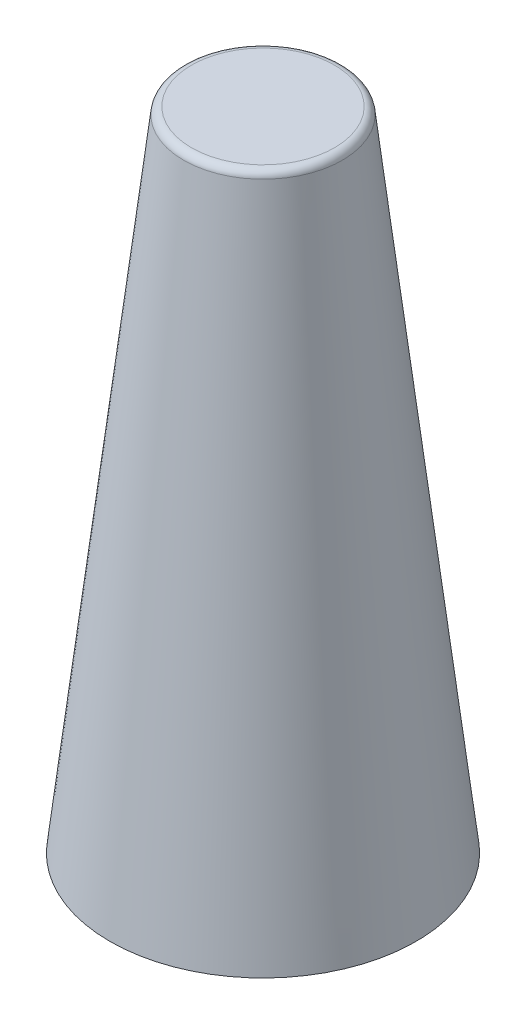
ISO-10303-21;
HEADER;
FILE_DESCRIPTION(('STEP AP214'),'2;1');
FILE_NAME('part.step','',(''),(''),'','','');
FILE_SCHEMA(('AUTOMOTIVE_DESIGN { 1 0 10303 214 1 1 1 1 }'));
ENDSEC;
DATA;
#1=APPLICATION_CONTEXT('core data for automotive mechanical design processes');
#2=APPLICATION_PROTOCOL_DEFINITION('international standard','automotive_design',2000,#1);
#3=PRODUCT_CONTEXT('',#1,'mechanical');
#4=PRODUCT('Part','Part','',(#3));
#5=PRODUCT_RELATED_PRODUCT_CATEGORY('part','',(#4));
#6=PRODUCT_DEFINITION_FORMATION('','',#4);
#7=PRODUCT_DEFINITION_CONTEXT('part definition',#1,'design');
#8=PRODUCT_DEFINITION('design','',#6,#7);
#9=PRODUCT_DEFINITION_SHAPE('','',#8);
#10=(LENGTH_UNIT() NAMED_UNIT(*) SI_UNIT(.MILLI.,.METRE.));
#11=(NAMED_UNIT(*) PLANE_ANGLE_UNIT() SI_UNIT($,.RADIAN.));
#12=(NAMED_UNIT(*) SI_UNIT($,.STERADIAN.) SOLID_ANGLE_UNIT());
#13=UNCERTAINTY_MEASURE_WITH_UNIT(LENGTH_MEASURE(1.E-05),#10,'distance_accuracy_value','');
#14=(GEOMETRIC_REPRESENTATION_CONTEXT(3) GLOBAL_UNCERTAINTY_ASSIGNED_CONTEXT((#13)) GLOBAL_UNIT_ASSIGNED_CONTEXT((#10,
#11,#12)) REPRESENTATION_CONTEXT('',''));
#15=CARTESIAN_POINT('',(0.,0.,0.));
#16=DIRECTION('',(0.,0.,1.));
#17=DIRECTION('',(1.,0.,0.));
#18=AXIS2_PLACEMENT_3D('',#15,#16,#17);
#19=CARTESIAN_POINT('',(0.,416.66959798995,0.));
#20=DIRECTION('',(0.,1.,0.));
#21=DIRECTION('',(0.,0.,1.));
#22=AXIS2_PLACEMENT_3D('',#19,#20,#21);
#23=PLANE('',#22);
#24=CARTESIAN_POINT('',(0.,416.66959798995,0.));
#25=DIRECTION('',(0.,1.,0.));
#26=DIRECTION('',(0.,0.,1.));
#27=AXIS2_PLACEMENT_3D('',#24,#25,#26);
#28=CIRCLE('',#27,91.0879119640147);
#29=CARTESIAN_POINT('',(0.,416.66959798995,91.0879119640147));
#30=VERTEX_POINT('',#29);
#31=EDGE_CURVE('E53',#30,#30,#28,.T.);
#32=ORIENTED_EDGE('',*,*,#31,.T.);
#33=EDGE_LOOP('',(#32));
#34=FACE_BOUND('',#33,.T.);
#35=ADVANCED_FACE('F44',(#34),#23,.T.);
#36=CARTESIAN_POINT('',(0.,416.66959798995,0.));
#37=DIRECTION('',(0.,-1.,0.));
#38=DIRECTION('',(0.,0.,-1.));
#39=AXIS2_PLACEMENT_3D('',#36,#37,#38);
#40=CONICAL_SURFACE('',#39,100.,0.114922724496329);
#41=CARTESIAN_POINT('',(0.,407.816297219638,0.));
#42=DIRECTION('',(0.,1.,0.));
#43=DIRECTION('',(0.,0.,1.));
#44=AXIS2_PLACEMENT_3D('',#41,#42,#43);
#45=CIRCLE('',#44,101.021948448578);
#46=CARTESIAN_POINT('',(0.,407.816297219638,101.021948448578));
#47=VERTEX_POINT('',#46);
#48=EDGE_CURVE('E10',#47,#47,#45,.F.);
#49=ORIENTED_EDGE('',*,*,#48,.T.);
#50=EDGE_LOOP('',(#49));
#51=FACE_BOUND('',#50,.T.);
#52=CARTESIAN_POINT('',(0.,-406.33040201005,0.));
#53=DIRECTION('',(0.,1.,0.));
#54=DIRECTION('',(0.,0.,1.));
#55=AXIS2_PLACEMENT_3D('',#52,#53,#54);
#56=CIRCLE('',#55,195.);
#57=CARTESIAN_POINT('',(0.,-406.33040201005,195.));
#58=VERTEX_POINT('',#57);
#59=EDGE_CURVE('E58',#58,#58,#56,.T.);
#60=ORIENTED_EDGE('',*,*,#59,.T.);
#61=EDGE_LOOP('',(#60));
#62=FACE_BOUND('',#61,.T.);
#63=ADVANCED_FACE('F96',(#51,#62),#40,.T.);
#64=CARTESIAN_POINT('',(0.,-406.33040201005,0.));
#65=DIRECTION('',(0.,1.,0.));
#66=DIRECTION('',(0.,0.,1.));
#67=AXIS2_PLACEMENT_3D('',#64,#65,#66);
#68=PLANE('',#67);
#69=ORIENTED_EDGE('',*,*,#59,.F.);
#70=EDGE_LOOP('',(#69));
#71=FACE_BOUND('',#70,.T.);
#72=ADVANCED_FACE('F94',(#71),#68,.F.);
#73=CARTESIAN_POINT('',(0.,406.66959798995,0.));
#74=DIRECTION('',(0.,1.,0.));
#75=DIRECTION('',(0.,0.,1.));
#76=AXIS2_PLACEMENT_3D('',#73,#74,#75);
#77=TOROIDAL_SURFACE('',#76,91.0879119640147,10.);
#78=ORIENTED_EDGE('',*,*,#48,.F.);
#79=EDGE_LOOP('',(#78));
#80=FACE_BOUND('',#79,.T.);
#81=ORIENTED_EDGE('',*,*,#31,.F.);
#82=EDGE_LOOP('',(#81));
#83=FACE_BOUND('',#82,.T.);
#84=ADVANCED_FACE('F46',(#80,#83),#77,.T.);
#85=CLOSED_SHELL('',(#35,#63,#72,#84));
#86=CARTESIAN_POINT('',(1.16521726812718E-13,-396.33040201005,0.));
#87=DIRECTION('',(0.,1.,0.));
#88=DIRECTION('',(0.,0.,1.));
#89=AXIS2_PLACEMENT_3D('',#86,#87,#88);
#90=PLANE('',#89);
#91=CARTESIAN_POINT('',(0.,-396.33040201005,0.));
#92=DIRECTION('',(0.,1.,0.));
#93=DIRECTION('',(0.,0.,1.));
#94=AXIS2_PLACEMENT_3D('',#91,#92,#93);
#95=CIRCLE('',#94,188.812485751145);
#96=CARTESIAN_POINT('',(0.,-396.33040201005,188.812485751145));
#97=VERTEX_POINT('',#96);
#98=EDGE_CURVE('E63',#97,#97,#95,.T.);
#99=ORIENTED_EDGE('',*,*,#98,.T.);
#100=EDGE_LOOP('',(#99));
#101=FACE_BOUND('',#100,.T.);
#102=ADVANCED_FACE('F84',(#101),#90,.T.);
#103=CARTESIAN_POINT('',(0.,406.66959798995,0.));
#104=DIRECTION('',(0.,-1.,0.));
#105=DIRECTION('',(0.,0.,-1.));
#106=AXIS2_PLACEMENT_3D('',#103,#104,#105);
#107=CONICAL_SURFACE('',#106,96.1211127256283,0.114922724496329);
#108=ORIENTED_EDGE('',*,*,#98,.F.);
#109=EDGE_LOOP('',(#108));
#110=FACE_BOUND('',#109,.T.);
#111=CARTESIAN_POINT('',(0.,406.66959798995,0.));
#112=DIRECTION('',(0.,1.,0.));
#113=DIRECTION('',(0.,0.,1.));
#114=AXIS2_PLACEMENT_3D('',#111,#112,#113);
#115=CIRCLE('',#114,96.1211127256283);
#116=CARTESIAN_POINT('',(0.,406.66959798995,96.1211127256283));
#117=VERTEX_POINT('',#116);
#118=EDGE_CURVE('E69',#117,#117,#115,.T.);
#119=ORIENTED_EDGE('',*,*,#118,.T.);
#120=EDGE_LOOP('',(#119));
#121=FACE_BOUND('',#120,.T.);
#122=ADVANCED_FACE('F74',(#110,#121),#107,.F.);
#123=CARTESIAN_POINT('',(0.,406.66959798995,0.));
#124=DIRECTION('',(0.,1.,0.));
#125=DIRECTION('',(0.,0.,1.));
#126=AXIS2_PLACEMENT_3D('',#123,#124,#125);
#127=PLANE('',#126);
#128=ORIENTED_EDGE('',*,*,#118,.F.);
#129=EDGE_LOOP('',(#128));
#130=FACE_BOUND('',#129,.T.);
#131=ADVANCED_FACE('F76',(#130),#127,.F.);
#132=CLOSED_SHELL('',(#102,#122,#131));
#133=ORIENTED_CLOSED_SHELL('',*,#132,.T.);
#134=BREP_WITH_VOIDS('B2',#85,(#133));
#135=ADVANCED_BREP_SHAPE_REPRESENTATION('',(#18,#134),#14);
#136=SHAPE_DEFINITION_REPRESENTATION(#9,#135);
ENDSEC;
END-ISO-10303-21;
